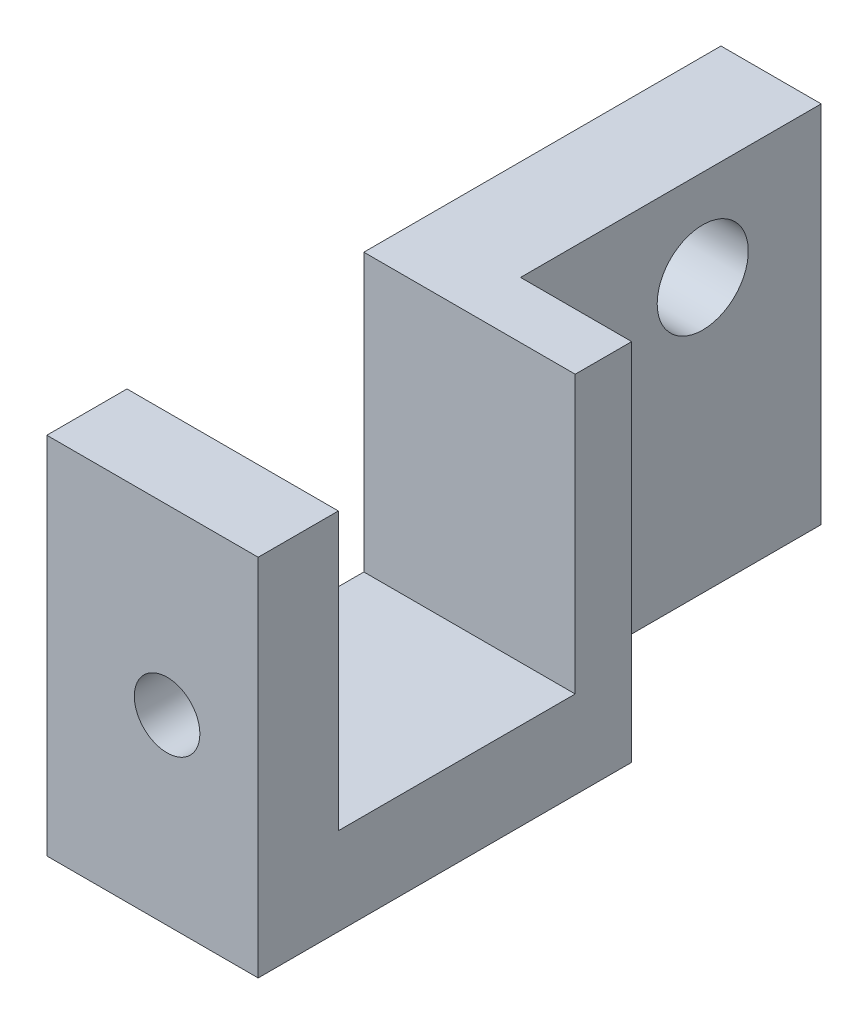
ISO-10303-21;
HEADER;
FILE_DESCRIPTION(('STEP AP214'),'2;1');
FILE_NAME('part.step','',(''),(''),'','','');
FILE_SCHEMA(('AUTOMOTIVE_DESIGN { 1 0 10303 214 1 1 1 1 }'));
ENDSEC;
DATA;
#1=APPLICATION_CONTEXT('core data for automotive mechanical design processes');
#2=APPLICATION_PROTOCOL_DEFINITION('international standard','automotive_design',2000,#1);
#3=PRODUCT_CONTEXT('',#1,'mechanical');
#4=PRODUCT('Part','Part','',(#3));
#5=PRODUCT_RELATED_PRODUCT_CATEGORY('part','',(#4));
#6=PRODUCT_DEFINITION_FORMATION('','',#4);
#7=PRODUCT_DEFINITION_CONTEXT('part definition',#1,'design');
#8=PRODUCT_DEFINITION('design','',#6,#7);
#9=PRODUCT_DEFINITION_SHAPE('','',#8);
#10=(LENGTH_UNIT() NAMED_UNIT(*) SI_UNIT(.MILLI.,.METRE.));
#11=(NAMED_UNIT(*) PLANE_ANGLE_UNIT() SI_UNIT($,.RADIAN.));
#12=(NAMED_UNIT(*) SI_UNIT($,.STERADIAN.) SOLID_ANGLE_UNIT());
#13=UNCERTAINTY_MEASURE_WITH_UNIT(LENGTH_MEASURE(1.E-05),#10,'distance_accuracy_value','');
#14=(GEOMETRIC_REPRESENTATION_CONTEXT(3) GLOBAL_UNCERTAINTY_ASSIGNED_CONTEXT((#13)) GLOBAL_UNIT_ASSIGNED_CONTEXT((#10,
#11,#12)) REPRESENTATION_CONTEXT('',''));
#15=CARTESIAN_POINT('',(0.,0.,0.));
#16=DIRECTION('',(0.,0.,1.));
#17=DIRECTION('',(1.,0.,0.));
#18=AXIS2_PLACEMENT_3D('',#15,#16,#17);
#19=CARTESIAN_POINT('',(7.366,12.7,-23.495));
#20=DIRECTION('',(-1.,0.,0.));
#21=DIRECTION('',(0.,0.,1.));
#22=AXIS2_PLACEMENT_3D('',#19,#20,#21);
#23=PLANE('',#22);
#24=DIRECTION('',(0.,-1.,0.));
#25=VECTOR('',#24,1.);
#26=CARTESIAN_POINT('',(7.366,12.7,-2.54));
#27=LINE('',#26,#25);
#28=CARTESIAN_POINT('',(7.366,12.7,-2.54));
#29=VERTEX_POINT('',#28);
#30=CARTESIAN_POINT('',(7.366,-12.7,-2.54));
#31=VERTEX_POINT('',#30);
#32=EDGE_CURVE('E48',#29,#31,#27,.T.);
#33=ORIENTED_EDGE('',*,*,#32,.F.);
#34=DIRECTION('',(0.,0.,-1.));
#35=VECTOR('',#34,1.);
#36=CARTESIAN_POINT('',(7.366,12.7,-23.495));
#37=LINE('',#36,#35);
#38=CARTESIAN_POINT('',(7.366,12.7,1.397));
#39=VERTEX_POINT('',#38);
#40=EDGE_CURVE('E172',#39,#29,#37,.T.);
#41=ORIENTED_EDGE('',*,*,#40,.F.);
#42=DIRECTION('',(0.,1.,0.));
#43=VECTOR('',#42,1.);
#44=CARTESIAN_POINT('',(7.366,12.7,1.397));
#45=LINE('',#44,#43);
#46=CARTESIAN_POINT('',(7.366,-6.604,1.397));
#47=VERTEX_POINT('',#46);
#48=EDGE_CURVE('E56',#47,#39,#45,.T.);
#49=ORIENTED_EDGE('',*,*,#48,.F.);
#50=DIRECTION('',(0.,0.,-1.));
#51=VECTOR('',#50,1.);
#52=CARTESIAN_POINT('',(7.366,-6.604,17.907));
#53=LINE('',#52,#51);
#54=CARTESIAN_POINT('',(7.366,-6.604,17.907));
#55=VERTEX_POINT('',#54);
#56=EDGE_CURVE('E154',#55,#47,#53,.T.);
#57=ORIENTED_EDGE('',*,*,#56,.F.);
#58=DIRECTION('',(0.,-1.,0.));
#59=VECTOR('',#58,1.);
#60=CARTESIAN_POINT('',(7.366,12.7,17.907));
#61=LINE('',#60,#59);
#62=CARTESIAN_POINT('',(7.366,12.7,17.907));
#63=VERTEX_POINT('',#62);
#64=EDGE_CURVE('E141',#63,#55,#61,.T.);
#65=ORIENTED_EDGE('',*,*,#64,.F.);
#66=CARTESIAN_POINT('',(7.366,12.7,23.495));
#67=VERTEX_POINT('',#66);
#68=EDGE_CURVE('E173',#67,#63,#37,.T.);
#69=ORIENTED_EDGE('',*,*,#68,.F.);
#70=DIRECTION('',(0.,-1.,0.));
#71=VECTOR('',#70,1.);
#72=CARTESIAN_POINT('',(7.366,12.7,23.495));
#73=LINE('',#72,#71);
#74=CARTESIAN_POINT('',(7.366,-12.7,23.495));
#75=VERTEX_POINT('',#74);
#76=EDGE_CURVE('E41',#67,#75,#73,.T.);
#77=ORIENTED_EDGE('',*,*,#76,.T.);
#78=DIRECTION('',(0.,0.,-1.));
#79=VECTOR('',#78,1.);
#80=CARTESIAN_POINT('',(7.366,-12.7,-23.495));
#81=LINE('',#80,#79);
#82=EDGE_CURVE('E183',#75,#31,#81,.T.);
#83=ORIENTED_EDGE('',*,*,#82,.T.);
#84=EDGE_LOOP('',(#33,#41,#49,#57,#65,#69,#77,#83));
#85=FACE_BOUND('',#84,.T.);
#86=ADVANCED_FACE('F32',(#85),#23,.F.);
#87=CARTESIAN_POINT('',(0.,12.7,0.));
#88=DIRECTION('',(0.,1.,0.));
#89=DIRECTION('',(0.,0.,1.));
#90=AXIS2_PLACEMENT_3D('',#87,#88,#89);
#91=PLANE('',#90);
#92=DIRECTION('',(1.,0.,0.));
#93=VECTOR('',#92,1.);
#94=CARTESIAN_POINT('',(-7.366,12.7,17.907));
#95=LINE('',#94,#93);
#96=CARTESIAN_POINT('',(-7.366,12.7,17.907));
#97=VERTEX_POINT('',#96);
#98=EDGE_CURVE('E158',#97,#63,#95,.T.);
#99=ORIENTED_EDGE('',*,*,#98,.F.);
#100=DIRECTION('',(0.,0.,1.));
#101=VECTOR('',#100,1.);
#102=CARTESIAN_POINT('',(-7.366,12.7,-23.495));
#103=LINE('',#102,#101);
#104=CARTESIAN_POINT('',(-7.366,12.7,23.495));
#105=VERTEX_POINT('',#104);
#106=EDGE_CURVE('E170',#97,#105,#103,.T.);
#107=ORIENTED_EDGE('',*,*,#106,.T.);
#108=DIRECTION('',(1.,0.,0.));
#109=VECTOR('',#108,1.);
#110=CARTESIAN_POINT('',(-7.366,12.7,23.495));
#111=LINE('',#110,#109);
#112=EDGE_CURVE('E169',#105,#67,#111,.T.);
#113=ORIENTED_EDGE('',*,*,#112,.T.);
#114=ORIENTED_EDGE('',*,*,#68,.T.);
#115=EDGE_LOOP('',(#99,#107,#113,#114));
#116=FACE_BOUND('',#115,.T.);
#117=ADVANCED_FACE('F216',(#116),#91,.T.);
#118=CARTESIAN_POINT('',(-7.366,12.7,-23.495));
#119=DIRECTION('',(1.,0.,0.));
#120=DIRECTION('',(0.,0.,-1.));
#121=AXIS2_PLACEMENT_3D('',#118,#119,#120);
#122=PLANE('',#121);
#123=CARTESIAN_POINT('',(-7.366,6.35,-15.24));
#124=DIRECTION('',(-1.,0.,0.));
#125=DIRECTION('',(0.,0.,1.));
#126=AXIS2_PLACEMENT_3D('',#123,#124,#125);
#127=CIRCLE('',#126,3.175);
#128=CARTESIAN_POINT('',(-7.366,6.35,-12.065));
#129=VERTEX_POINT('',#128);
#130=EDGE_CURVE('E207',#129,#129,#127,.T.);
#131=ORIENTED_EDGE('',*,*,#130,.F.);
#132=EDGE_LOOP('',(#131));
#133=FACE_BOUND('',#132,.T.);
#134=ORIENTED_EDGE('',*,*,#106,.F.);
#135=DIRECTION('',(0.,-1.,0.));
#136=VECTOR('',#135,1.);
#137=CARTESIAN_POINT('',(-7.366,12.7,17.907));
#138=LINE('',#137,#136);
#139=CARTESIAN_POINT('',(-7.366,-6.604,17.907));
#140=VERTEX_POINT('',#139);
#141=EDGE_CURVE('E142',#97,#140,#138,.T.);
#142=ORIENTED_EDGE('',*,*,#141,.T.);
#143=DIRECTION('',(0.,0.,-1.));
#144=VECTOR('',#143,1.);
#145=CARTESIAN_POINT('',(-7.366,-6.604,17.907));
#146=LINE('',#145,#144);
#147=CARTESIAN_POINT('',(-7.366,-6.604,1.397));
#148=VERTEX_POINT('',#147);
#149=EDGE_CURVE('E145',#140,#148,#146,.T.);
#150=ORIENTED_EDGE('',*,*,#149,.T.);
#151=DIRECTION('',(0.,1.,0.));
#152=VECTOR('',#151,1.);
#153=CARTESIAN_POINT('',(-7.366,12.7,1.397));
#154=LINE('',#153,#152);
#155=CARTESIAN_POINT('',(-7.366,12.7,1.397));
#156=VERTEX_POINT('',#155);
#157=EDGE_CURVE('E148',#148,#156,#154,.T.);
#158=ORIENTED_EDGE('',*,*,#157,.T.);
#159=CARTESIAN_POINT('',(-7.366,12.7,-23.495));
#160=VERTEX_POINT('',#159);
#161=EDGE_CURVE('E166',#160,#156,#103,.T.);
#162=ORIENTED_EDGE('',*,*,#161,.F.);
#163=DIRECTION('',(0.,-1.,0.));
#164=VECTOR('',#163,1.);
#165=CARTESIAN_POINT('',(-7.366,12.7,-23.495));
#166=LINE('',#165,#164);
#167=CARTESIAN_POINT('',(-7.366,-12.7,-23.495));
#168=VERTEX_POINT('',#167);
#169=EDGE_CURVE('E178',#160,#168,#166,.T.);
#170=ORIENTED_EDGE('',*,*,#169,.T.);
#171=DIRECTION('',(0.,0.,1.));
#172=VECTOR('',#171,1.);
#173=CARTESIAN_POINT('',(-7.366,-12.7,-23.495));
#174=LINE('',#173,#172);
#175=CARTESIAN_POINT('',(-7.366,-12.7,23.495));
#176=VERTEX_POINT('',#175);
#177=EDGE_CURVE('E160',#168,#176,#174,.T.);
#178=ORIENTED_EDGE('',*,*,#177,.T.);
#179=DIRECTION('',(0.,-1.,0.));
#180=VECTOR('',#179,1.);
#181=CARTESIAN_POINT('',(-7.366,12.7,23.495));
#182=LINE('',#181,#180);
#183=EDGE_CURVE('E11',#105,#176,#182,.T.);
#184=ORIENTED_EDGE('',*,*,#183,.F.);
#185=EDGE_LOOP('',(#134,#142,#150,#158,#162,#170,#178,#184));
#186=FACE_BOUND('',#185,.T.);
#187=ADVANCED_FACE('F34',(#133,#186),#122,.F.);
#188=CARTESIAN_POINT('',(-7.366,12.7,23.495));
#189=DIRECTION('',(0.,0.,-1.));
#190=DIRECTION('',(-1.,0.,0.));
#191=AXIS2_PLACEMENT_3D('',#188,#189,#190);
#192=PLANE('',#191);
#193=CARTESIAN_POINT('',(1.016,0.,23.495));
#194=DIRECTION('',(0.,0.,1.));
#195=DIRECTION('',(1.,0.,0.));
#196=AXIS2_PLACEMENT_3D('',#193,#194,#195);
#197=CIRCLE('',#196,2.286);
#198=CARTESIAN_POINT('',(3.302,0.,23.495));
#199=VERTEX_POINT('',#198);
#200=EDGE_CURVE('E131',#199,#199,#197,.T.);
#201=ORIENTED_EDGE('',*,*,#200,.F.);
#202=EDGE_LOOP('',(#201));
#203=FACE_BOUND('',#202,.T.);
#204=DIRECTION('',(1.,0.,0.));
#205=VECTOR('',#204,1.);
#206=CARTESIAN_POINT('',(-7.366,-12.7,23.495));
#207=LINE('',#206,#205);
#208=EDGE_CURVE('E181',#176,#75,#207,.T.);
#209=ORIENTED_EDGE('',*,*,#208,.T.);
#210=ORIENTED_EDGE('',*,*,#76,.F.);
#211=ORIENTED_EDGE('',*,*,#112,.F.);
#212=ORIENTED_EDGE('',*,*,#183,.T.);
#213=EDGE_LOOP('',(#209,#210,#211,#212));
#214=FACE_BOUND('',#213,.T.);
#215=ADVANCED_FACE('F196',(#203,#214),#192,.F.);
#216=CARTESIAN_POINT('',(-7.366,12.7,-23.495));
#217=DIRECTION('',(0.,0.,1.));
#218=DIRECTION('',(1.,0.,0.));
#219=AXIS2_PLACEMENT_3D('',#216,#217,#218);
#220=PLANE('',#219);
#221=DIRECTION('',(-1.,0.,0.));
#222=VECTOR('',#221,1.);
#223=CARTESIAN_POINT('',(-7.366,12.7,-23.495));
#224=LINE('',#223,#222);
#225=CARTESIAN_POINT('',(-0.381000000000003,12.7,-23.495));
#226=VERTEX_POINT('',#225);
#227=EDGE_CURVE('E176',#226,#160,#224,.T.);
#228=ORIENTED_EDGE('',*,*,#227,.F.);
#229=DIRECTION('',(0.,1.,0.));
#230=VECTOR('',#229,1.);
#231=CARTESIAN_POINT('',(-0.381000000000003,12.7,-23.495));
#232=LINE('',#231,#230);
#233=CARTESIAN_POINT('',(-0.381000000000006,-12.7,-23.495));
#234=VERTEX_POINT('',#233);
#235=EDGE_CURVE('E204',#234,#226,#232,.T.);
#236=ORIENTED_EDGE('',*,*,#235,.F.);
#237=DIRECTION('',(-1.,0.,0.));
#238=VECTOR('',#237,1.);
#239=CARTESIAN_POINT('',(-7.366,-12.7,-23.495));
#240=LINE('',#239,#238);
#241=EDGE_CURVE('E129',#234,#168,#240,.T.);
#242=ORIENTED_EDGE('',*,*,#241,.T.);
#243=ORIENTED_EDGE('',*,*,#169,.F.);
#244=EDGE_LOOP('',(#228,#236,#242,#243));
#245=FACE_BOUND('',#244,.T.);
#246=ADVANCED_FACE('F203',(#245),#220,.F.);
#247=DIRECTION('',(0.,0.,-1.));
#248=VECTOR('',#247,1.);
#249=CARTESIAN_POINT('',(-0.381000000000003,12.7,-2.54));
#250=LINE('',#249,#248);
#251=CARTESIAN_POINT('',(-0.381000000000003,12.7,-2.54));
#252=VERTEX_POINT('',#251);
#253=EDGE_CURVE('E116',#252,#226,#250,.T.);
#254=ORIENTED_EDGE('',*,*,#253,.T.);
#255=ORIENTED_EDGE('',*,*,#227,.T.);
#256=ORIENTED_EDGE('',*,*,#161,.T.);
#257=DIRECTION('',(1.,0.,0.));
#258=VECTOR('',#257,1.);
#259=CARTESIAN_POINT('',(-7.366,12.7,1.397));
#260=LINE('',#259,#258);
#261=EDGE_CURVE('E161',#156,#39,#260,.T.);
#262=ORIENTED_EDGE('',*,*,#261,.T.);
#263=ORIENTED_EDGE('',*,*,#40,.T.);
#264=DIRECTION('',(1.,0.,0.));
#265=VECTOR('',#264,1.);
#266=CARTESIAN_POINT('',(7.366,12.7,-2.54));
#267=LINE('',#266,#265);
#268=EDGE_CURVE('E118',#252,#29,#267,.T.);
#269=ORIENTED_EDGE('',*,*,#268,.F.);
#270=EDGE_LOOP('',(#254,#255,#256,#262,#263,#269));
#271=FACE_BOUND('',#270,.T.);
#272=ADVANCED_FACE('F224',(#271),#91,.T.);
#273=CARTESIAN_POINT('',(0.,-12.7,0.));
#274=DIRECTION('',(0.,1.,0.));
#275=DIRECTION('',(0.,0.,1.));
#276=AXIS2_PLACEMENT_3D('',#273,#274,#275);
#277=PLANE('',#276);
#278=ORIENTED_EDGE('',*,*,#241,.F.);
#279=DIRECTION('',(0.,0.,-1.));
#280=VECTOR('',#279,1.);
#281=CARTESIAN_POINT('',(-0.381000000000006,-12.7,-2.54));
#282=LINE('',#281,#280);
#283=CARTESIAN_POINT('',(-0.381000000000006,-12.7,-2.54));
#284=VERTEX_POINT('',#283);
#285=EDGE_CURVE('E113',#284,#234,#282,.T.);
#286=ORIENTED_EDGE('',*,*,#285,.F.);
#287=DIRECTION('',(-1.,0.,0.));
#288=VECTOR('',#287,1.);
#289=CARTESIAN_POINT('',(7.36599999999999,-12.7,-2.54));
#290=LINE('',#289,#288);
#291=EDGE_CURVE('E119',#31,#284,#290,.T.);
#292=ORIENTED_EDGE('',*,*,#291,.F.);
#293=ORIENTED_EDGE('',*,*,#82,.F.);
#294=ORIENTED_EDGE('',*,*,#208,.F.);
#295=ORIENTED_EDGE('',*,*,#177,.F.);
#296=EDGE_LOOP('',(#278,#286,#292,#293,#294,#295));
#297=FACE_BOUND('',#296,.T.);
#298=ADVANCED_FACE('F127',(#297),#277,.F.);
#299=CARTESIAN_POINT('',(-7.366,12.7,17.907));
#300=DIRECTION('',(0.,0.,1.));
#301=DIRECTION('',(0.,-1.,0.));
#302=AXIS2_PLACEMENT_3D('',#299,#300,#301);
#303=PLANE('',#302);
#304=CARTESIAN_POINT('',(1.016,0.,17.907));
#305=DIRECTION('',(0.,0.,1.));
#306=DIRECTION('',(0.,-1.,0.));
#307=AXIS2_PLACEMENT_3D('',#304,#305,#306);
#308=CIRCLE('',#307,2.286);
#309=CARTESIAN_POINT('',(1.016,-2.286,17.907));
#310=VERTEX_POINT('',#309);
#311=EDGE_CURVE('E138',#310,#310,#308,.F.);
#312=ORIENTED_EDGE('',*,*,#311,.F.);
#313=EDGE_LOOP('',(#312));
#314=FACE_BOUND('',#313,.T.);
#315=ORIENTED_EDGE('',*,*,#64,.T.);
#316=DIRECTION('',(1.,0.,0.));
#317=VECTOR('',#316,1.);
#318=CARTESIAN_POINT('',(-7.366,-6.604,17.907));
#319=LINE('',#318,#317);
#320=EDGE_CURVE('E151',#140,#55,#319,.T.);
#321=ORIENTED_EDGE('',*,*,#320,.F.);
#322=ORIENTED_EDGE('',*,*,#141,.F.);
#323=ORIENTED_EDGE('',*,*,#98,.T.);
#324=EDGE_LOOP('',(#315,#321,#322,#323));
#325=FACE_BOUND('',#324,.T.);
#326=ADVANCED_FACE('F233',(#314,#325),#303,.F.);
#327=CARTESIAN_POINT('',(-7.366,12.7,1.397));
#328=DIRECTION('',(0.,0.,-1.));
#329=DIRECTION('',(0.,1.,0.));
#330=AXIS2_PLACEMENT_3D('',#327,#328,#329);
#331=PLANE('',#330);
#332=ORIENTED_EDGE('',*,*,#48,.T.);
#333=ORIENTED_EDGE('',*,*,#261,.F.);
#334=ORIENTED_EDGE('',*,*,#157,.F.);
#335=DIRECTION('',(1.,0.,0.));
#336=VECTOR('',#335,1.);
#337=CARTESIAN_POINT('',(-7.366,-6.604,1.397));
#338=LINE('',#337,#336);
#339=EDGE_CURVE('E163',#148,#47,#338,.T.);
#340=ORIENTED_EDGE('',*,*,#339,.T.);
#341=EDGE_LOOP('',(#332,#333,#334,#340));
#342=FACE_BOUND('',#341,.T.);
#343=ADVANCED_FACE('F239',(#342),#331,.F.);
#344=CARTESIAN_POINT('',(-7.366,-6.604,17.907));
#345=DIRECTION('',(0.,-1.,0.));
#346=DIRECTION('',(0.,0.,-1.));
#347=AXIS2_PLACEMENT_3D('',#344,#345,#346);
#348=PLANE('',#347);
#349=ORIENTED_EDGE('',*,*,#56,.T.);
#350=ORIENTED_EDGE('',*,*,#339,.F.);
#351=ORIENTED_EDGE('',*,*,#149,.F.);
#352=ORIENTED_EDGE('',*,*,#320,.T.);
#353=EDGE_LOOP('',(#349,#350,#351,#352));
#354=FACE_BOUND('',#353,.T.);
#355=ADVANCED_FACE('F241',(#354),#348,.F.);
#356=CARTESIAN_POINT('',(1.016,0.,-23.496));
#357=DIRECTION('',(0.,0.,1.));
#358=DIRECTION('',(1.,0.,0.));
#359=AXIS2_PLACEMENT_3D('',#356,#357,#358);
#360=CYLINDRICAL_SURFACE('',#359,2.286);
#361=ORIENTED_EDGE('',*,*,#200,.T.);
#362=EDGE_LOOP('',(#361));
#363=FACE_BOUND('',#362,.T.);
#364=ORIENTED_EDGE('',*,*,#311,.T.);
#365=EDGE_LOOP('',(#364));
#366=FACE_BOUND('',#365,.T.);
#367=ADVANCED_FACE('F244',(#363,#366),#360,.F.);
#368=CARTESIAN_POINT('',(-0.381000000000003,12.7,-2.54));
#369=DIRECTION('',(-1.,0.,0.));
#370=DIRECTION('',(0.,-1.,0.));
#371=AXIS2_PLACEMENT_3D('',#368,#369,#370);
#372=PLANE('',#371);
#373=CARTESIAN_POINT('',(-0.381000000000004,6.35,-15.24));
#374=DIRECTION('',(-1.,0.,0.));
#375=DIRECTION('',(0.,-1.,0.));
#376=AXIS2_PLACEMENT_3D('',#373,#374,#375);
#377=CIRCLE('',#376,3.175);
#378=CARTESIAN_POINT('',(-0.381000000000004,3.175,-15.24));
#379=VERTEX_POINT('',#378);
#380=EDGE_CURVE('E36',#379,#379,#377,.T.);
#381=ORIENTED_EDGE('',*,*,#380,.T.);
#382=EDGE_LOOP('',(#381));
#383=FACE_BOUND('',#382,.T.);
#384=ORIENTED_EDGE('',*,*,#235,.T.);
#385=ORIENTED_EDGE('',*,*,#253,.F.);
#386=DIRECTION('',(0.,1.,0.));
#387=VECTOR('',#386,1.);
#388=CARTESIAN_POINT('',(-0.381000000000003,12.7,-2.54));
#389=LINE('',#388,#387);
#390=EDGE_CURVE('E110',#284,#252,#389,.T.);
#391=ORIENTED_EDGE('',*,*,#390,.F.);
#392=ORIENTED_EDGE('',*,*,#285,.T.);
#393=EDGE_LOOP('',(#384,#385,#391,#392));
#394=FACE_BOUND('',#393,.T.);
#395=ADVANCED_FACE('F111',(#383,#394),#372,.F.);
#396=CARTESIAN_POINT('',(0.,0.,-2.54));
#397=DIRECTION('',(0.,0.,-1.));
#398=DIRECTION('',(-1.,0.,0.));
#399=AXIS2_PLACEMENT_3D('',#396,#397,#398);
#400=PLANE('',#399);
#401=ORIENTED_EDGE('',*,*,#32,.T.);
#402=ORIENTED_EDGE('',*,*,#291,.T.);
#403=ORIENTED_EDGE('',*,*,#390,.T.);
#404=ORIENTED_EDGE('',*,*,#268,.T.);
#405=EDGE_LOOP('',(#401,#402,#403,#404));
#406=FACE_BOUND('',#405,.T.);
#407=ADVANCED_FACE('F121',(#406),#400,.T.);
#408=CARTESIAN_POINT('',(7.366,6.35,-15.24));
#409=DIRECTION('',(-1.,0.,0.));
#410=DIRECTION('',(0.,0.,1.));
#411=AXIS2_PLACEMENT_3D('',#408,#409,#410);
#412=CYLINDRICAL_SURFACE('',#411,3.175);
#413=ORIENTED_EDGE('',*,*,#130,.T.);
#414=EDGE_LOOP('',(#413));
#415=FACE_BOUND('',#414,.T.);
#416=ORIENTED_EDGE('',*,*,#380,.F.);
#417=EDGE_LOOP('',(#416));
#418=FACE_BOUND('',#417,.T.);
#419=ADVANCED_FACE('F212',(#415,#418),#412,.F.);
#420=CLOSED_SHELL('',(#86,#117,#187,#215,#246,#272,#298,#326,#343,#355,#367,#395,#407,#419));
#421=MANIFOLD_SOLID_BREP('B2',#420);
#422=ADVANCED_BREP_SHAPE_REPRESENTATION('',(#18,#421),#14);
#423=SHAPE_DEFINITION_REPRESENTATION(#9,#422);
ENDSEC;
END-ISO-10303-21;
